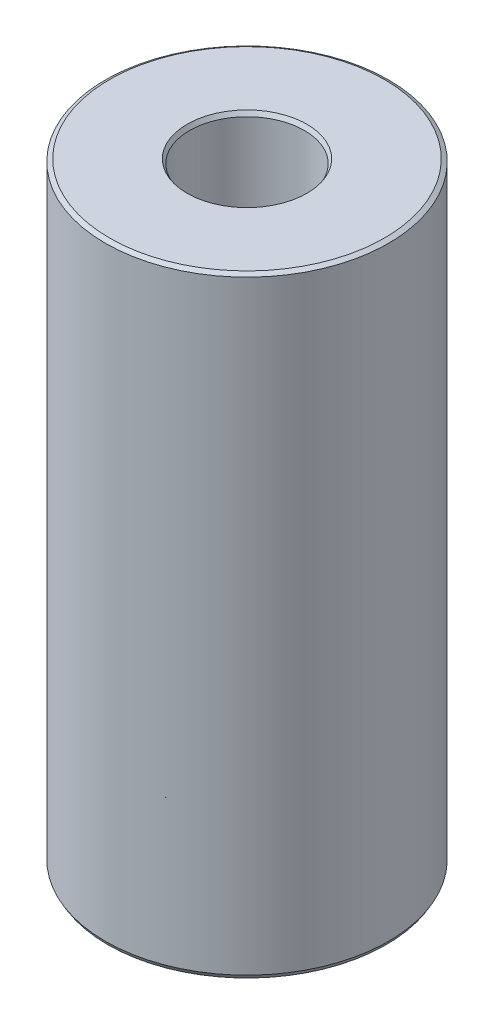
ISO-10303-21;
HEADER;
FILE_DESCRIPTION(('STEP AP214'),'2;1');
FILE_NAME('part.step','',(''),(''),'','','');
FILE_SCHEMA(('AUTOMOTIVE_DESIGN { 1 0 10303 214 1 1 1 1 }'));
ENDSEC;
DATA;
#1=APPLICATION_CONTEXT('core data for automotive mechanical design processes');
#2=APPLICATION_PROTOCOL_DEFINITION('international standard','automotive_design',2000,#1);
#3=PRODUCT_CONTEXT('',#1,'mechanical');
#4=PRODUCT('Part','Part','',(#3));
#5=PRODUCT_RELATED_PRODUCT_CATEGORY('part','',(#4));
#6=PRODUCT_DEFINITION_FORMATION('','',#4);
#7=PRODUCT_DEFINITION_CONTEXT('part definition',#1,'design');
#8=PRODUCT_DEFINITION('design','',#6,#7);
#9=PRODUCT_DEFINITION_SHAPE('','',#8);
#10=(LENGTH_UNIT() NAMED_UNIT(*) SI_UNIT(.MILLI.,.METRE.));
#11=(NAMED_UNIT(*) PLANE_ANGLE_UNIT() SI_UNIT($,.RADIAN.));
#12=(NAMED_UNIT(*) SI_UNIT($,.STERADIAN.) SOLID_ANGLE_UNIT());
#13=UNCERTAINTY_MEASURE_WITH_UNIT(LENGTH_MEASURE(1.E-05),#10,'distance_accuracy_value','');
#14=(GEOMETRIC_REPRESENTATION_CONTEXT(3) GLOBAL_UNCERTAINTY_ASSIGNED_CONTEXT((#13)) GLOBAL_UNIT_ASSIGNED_CONTEXT((#10,
#11,#12)) REPRESENTATION_CONTEXT('',''));
#15=CARTESIAN_POINT('',(0.,0.,0.));
#16=DIRECTION('',(0.,0.,1.));
#17=DIRECTION('',(1.,0.,0.));
#18=AXIS2_PLACEMENT_3D('',#15,#16,#17);
#19=CARTESIAN_POINT('',(0.,215.817890660873,0.));
#20=DIRECTION('',(0.,-1.,0.));
#21=DIRECTION('',(0.,0.,-1.));
#22=AXIS2_PLACEMENT_3D('',#19,#20,#21);
#23=CYLINDRICAL_SURFACE('',#22,50.);
#24=CARTESIAN_POINT('',(0.,1.484774727462,0.));
#25=DIRECTION('',(0.,1.,0.));
#26=DIRECTION('',(0.,0.,1.));
#27=AXIS2_PLACEMENT_3D('',#24,#25,#26);
#28=CIRCLE('',#27,50.);
#29=CARTESIAN_POINT('',(0.,1.484774727462,-50.));
#30=VERTEX_POINT('',#29);
#31=EDGE_CURVE('E10',#30,#30,#28,.T.);
#32=CARTESIAN_POINT('',(0.,214.960655572288,0.));
#33=DIRECTION('',(0.,1.,0.));
#34=DIRECTION('',(0.,0.,1.));
#35=AXIS2_PLACEMENT_3D('',#32,#33,#34);
#36=CIRCLE('',#35,50.);
#37=CARTESIAN_POINT('',(0.,214.960655572288,-50.));
#38=VERTEX_POINT('',#37);
#39=EDGE_CURVE('E50',#38,#38,#36,.F.);
#40=CARTESIAN_POINT('',(0.,1.484774727462,-50.));
#41=CARTESIAN_POINT('',(0.,3.7084818195956,-50.));
#42=CARTESIAN_POINT('',(0.,5.9321889117292,-50.));
#43=CARTESIAN_POINT('',(0.,10.3796030959964,-50.));
#44=CARTESIAN_POINT('',(0.,12.60331018813,-50.));
#45=CARTESIAN_POINT('',(0.,17.0507243723972,-50.));
#46=CARTESIAN_POINT('',(0.,19.2744314645308,-50.));
#47=CARTESIAN_POINT('',(0.,23.721845648798,-50.));
#48=CARTESIAN_POINT('',(0.,25.9455527409316,-50.));
#49=CARTESIAN_POINT('',(0.,30.3929669251988,-50.));
#50=CARTESIAN_POINT('',(0.,32.6166740173324,-50.));
#51=CARTESIAN_POINT('',(0.,37.0640882015996,-50.));
#52=CARTESIAN_POINT('',(0.,39.2877952937332,-50.));
#53=CARTESIAN_POINT('',(0.,43.7352094780004,-50.));
#54=CARTESIAN_POINT('',(0.,45.958916570134,-50.));
#55=CARTESIAN_POINT('',(0.,50.4063307544012,-50.));
#56=CARTESIAN_POINT('',(0.,52.6300378465348,-50.));
#57=CARTESIAN_POINT('',(0.,57.077452030802,-50.));
#58=CARTESIAN_POINT('',(0.,59.3011591229356,-50.));
#59=CARTESIAN_POINT('',(0.,63.7485733072028,-50.));
#60=CARTESIAN_POINT('',(0.,65.9722803993364,-50.));
#61=CARTESIAN_POINT('',(0.,70.4196945836036,-50.));
#62=CARTESIAN_POINT('',(0.,72.6434016757372,-50.));
#63=CARTESIAN_POINT('',(0.,77.0908158600044,-50.));
#64=CARTESIAN_POINT('',(0.,79.314522952138,-50.));
#65=CARTESIAN_POINT('',(0.,83.7619371364052,-50.));
#66=CARTESIAN_POINT('',(0.,85.9856442285388,-50.));
#67=CARTESIAN_POINT('',(0.,90.433058412806,-50.));
#68=CARTESIAN_POINT('',(0.,92.6567655049396,-50.));
#69=CARTESIAN_POINT('',(0.,97.1041796892068,-50.));
#70=CARTESIAN_POINT('',(0.,99.3278867813404,-50.));
#71=CARTESIAN_POINT('',(0.,103.775300965608,-50.));
#72=CARTESIAN_POINT('',(0.,105.999008057741,-50.));
#73=CARTESIAN_POINT('',(0.,110.446422242008,-50.));
#74=CARTESIAN_POINT('',(0.,112.670129334142,-50.));
#75=CARTESIAN_POINT('',(0.,117.117543518409,-50.));
#76=CARTESIAN_POINT('',(0.,119.341250610543,-50.));
#77=CARTESIAN_POINT('',(0.,123.78866479481,-50.));
#78=CARTESIAN_POINT('',(0.,126.012371886944,-50.));
#79=CARTESIAN_POINT('',(0.,130.459786071211,-50.));
#80=CARTESIAN_POINT('',(0.,132.683493163344,-50.));
#81=CARTESIAN_POINT('',(0.,137.130907347612,-50.));
#82=CARTESIAN_POINT('',(0.,139.354614439745,-50.));
#83=CARTESIAN_POINT('',(0.,143.802028624012,-50.));
#84=CARTESIAN_POINT('',(0.,146.025735716146,-50.));
#85=CARTESIAN_POINT('',(0.,150.473149900413,-50.));
#86=CARTESIAN_POINT('',(0.,152.696856992547,-50.));
#87=CARTESIAN_POINT('',(0.,157.144271176814,-50.));
#88=CARTESIAN_POINT('',(0.,159.367978268948,-50.));
#89=CARTESIAN_POINT('',(0.,163.815392453215,-50.));
#90=CARTESIAN_POINT('',(0.,166.039099545348,-50.));
#91=CARTESIAN_POINT('',(0.,170.486513729616,-50.));
#92=CARTESIAN_POINT('',(0.,172.710220821749,-50.));
#93=CARTESIAN_POINT('',(0.,177.157635006016,-50.));
#94=CARTESIAN_POINT('',(0.,179.38134209815,-50.));
#95=CARTESIAN_POINT('',(0.,183.828756282417,-50.));
#96=CARTESIAN_POINT('',(0.,186.052463374551,-50.));
#97=CARTESIAN_POINT('',(0.,190.499877558818,-50.));
#98=CARTESIAN_POINT('',(0.,192.723584650952,-50.));
#99=CARTESIAN_POINT('',(0.,197.170998835219,-50.));
#100=CARTESIAN_POINT('',(0.,199.394705927352,-50.));
#101=CARTESIAN_POINT('',(0.,203.84212011162,-50.));
#102=CARTESIAN_POINT('',(0.,206.065827203753,-50.));
#103=CARTESIAN_POINT('',(0.,210.51324138802,-50.));
#104=CARTESIAN_POINT('',(0.,212.736948480154,-50.));
#105=CARTESIAN_POINT('',(0.,214.960655572288,-50.));
#106=B_SPLINE_CURVE_WITH_KNOTS('',3,(#40,#41,#42,#43,#44,#45,#46,#47,#48,#49,#50,#51,#52,#53,
#54,#55,#56,#57,#58,#59,#60,#61,#62,#63,#64,#65,#66,#67,#68,#69,#70,#71,#72,#73,#74,#75,#76,#77,
#78,#79,#80,#81,#82,#83,#84,#85,#86,#87,#88,#89,#90,#91,#92,#93,#94,#95,#96,#97,#98,#99,#100,
#101,#102,#103,#104,#105),.UNSPECIFIED.,.F.,.F.,(4,2,2,2,2,2,2,2,2,2,2,2,2,2,2,2,2,2,2,2,2,2,2,
2,2,2,2,2,2,2,2,2,4),(0.,6.67112127640079,13.3422425528016,20.0133638292024,26.6844851056032,
33.355606382004,40.0267276584048,46.6978489348056,53.3689702112064,60.0400914876072,
66.711212764008,73.3823340404088,80.0534553168096,86.7245765932104,93.3956978696112,
100.066819146012,106.737940422413,113.409061698814,120.080182975214,126.751304251615,
133.422425528016,140.093546804417,146.764668080818,153.435789357218,160.106910633619,
166.77803191002,173.449153186421,180.120274462822,186.791395739222,193.462517015623,
200.133638292024,206.804759568425,213.475880844826),.UNSPECIFIED.);
#107=EDGE_CURVE('BSEAM39',#30,#38,#106,.T.);
#108=ORIENTED_EDGE('',*,*,#31,.T.);
#109=ORIENTED_EDGE('',*,*,#39,.T.);
#110=ORIENTED_EDGE('',*,*,#107,.T.);
#111=ORIENTED_EDGE('',*,*,#107,.F.);
#112=EDGE_LOOP('',(#108,#110,#109,#111));
#113=FACE_BOUND('',#112,.T.);
#114=ADVANCED_FACE('F39',(#113),#23,.T.);
#115=CARTESIAN_POINT('',(0.,215.817890660873,0.));
#116=DIRECTION('',(0.,1.,0.));
#117=DIRECTION('',(0.,0.,1.));
#118=AXIS2_PLACEMENT_3D('',#115,#116,#117);
#119=PLANE('',#118);
#120=CARTESIAN_POINT('',(0.,215.817890660873,0.));
#121=DIRECTION('',(0.,1.,0.));
#122=DIRECTION('',(0.,0.,1.));
#123=AXIS2_PLACEMENT_3D('',#120,#121,#122);
#124=CIRCLE('',#123,21.1518434626382);
#125=CARTESIAN_POINT('',(0.,215.817890660873,21.1518434626382));
#126=VERTEX_POINT('',#125);
#127=EDGE_CURVE('E58',#126,#126,#124,.F.);
#128=ORIENTED_EDGE('',*,*,#127,.T.);
#129=EDGE_LOOP('',(#128));
#130=FACE_BOUND('',#129,.T.);
#131=CARTESIAN_POINT('',(0.,215.817890660873,0.));
#132=DIRECTION('',(0.,1.,0.));
#133=DIRECTION('',(0.,0.,1.));
#134=AXIS2_PLACEMENT_3D('',#131,#132,#133);
#135=CIRCLE('',#134,48.5152252725387);
#136=CARTESIAN_POINT('',(0.,215.817890660873,48.5152252725387));
#137=VERTEX_POINT('',#136);
#138=EDGE_CURVE('E61',#137,#137,#135,.T.);
#139=ORIENTED_EDGE('',*,*,#138,.T.);
#140=EDGE_LOOP('',(#139));
#141=FACE_BOUND('',#140,.T.);
#142=ADVANCED_FACE('F88',(#130,#141),#119,.T.);
#143=CARTESIAN_POINT('',(0.,0.,0.));
#144=DIRECTION('',(0.,1.,0.));
#145=DIRECTION('',(0.,0.,1.));
#146=AXIS2_PLACEMENT_3D('',#143,#144,#145);
#147=PLANE('',#146);
#148=CARTESIAN_POINT('',(0.,0.,0.));
#149=DIRECTION('',(0.,1.,0.));
#150=DIRECTION('',(0.,0.,1.));
#151=AXIS2_PLACEMENT_3D('',#148,#149,#150);
#152=CIRCLE('',#151,21.7793831015137);
#153=CARTESIAN_POINT('',(0.,0.,21.7793831015137));
#154=VERTEX_POINT('',#153);
#155=EDGE_CURVE('E51',#154,#154,#152,.T.);
#156=ORIENTED_EDGE('',*,*,#155,.T.);
#157=EDGE_LOOP('',(#156));
#158=FACE_BOUND('',#157,.T.);
#159=CARTESIAN_POINT('',(0.,0.,0.));
#160=DIRECTION('',(0.,1.,0.));
#161=DIRECTION('',(0.,0.,1.));
#162=AXIS2_PLACEMENT_3D('',#159,#160,#161);
#163=CIRCLE('',#162,49.1427649114139);
#164=CARTESIAN_POINT('',(0.,0.,49.1427649114139));
#165=VERTEX_POINT('',#164);
#166=EDGE_CURVE('E54',#165,#165,#163,.F.);
#167=ORIENTED_EDGE('',*,*,#166,.T.);
#168=EDGE_LOOP('',(#167));
#169=FACE_BOUND('',#168,.T.);
#170=ADVANCED_FACE('F83',(#158,#169),#147,.F.);
#171=CARTESIAN_POINT('',(0.,215.817890660873,0.));
#172=DIRECTION('',(0.,-1.,0.));
#173=DIRECTION('',(0.,0.,-1.));
#174=AXIS2_PLACEMENT_3D('',#171,#172,#173);
#175=CYLINDRICAL_SURFACE('',#174,20.2946083740523);
#176=CARTESIAN_POINT('',(0.,214.333115933412,0.));
#177=DIRECTION('',(0.,1.,0.));
#178=DIRECTION('',(0.,0.,1.));
#179=AXIS2_PLACEMENT_3D('',#176,#177,#178);
#180=CIRCLE('',#179,20.2946083740523);
#181=CARTESIAN_POINT('',(0.,214.333115933412,-20.2946083740523));
#182=VERTEX_POINT('',#181);
#183=EDGE_CURVE('E67',#182,#182,#180,.T.);
#184=CARTESIAN_POINT('',(0.,0.857235088585789,0.));
#185=DIRECTION('',(0.,1.,0.));
#186=DIRECTION('',(0.,0.,1.));
#187=AXIS2_PLACEMENT_3D('',#184,#185,#186);
#188=CIRCLE('',#187,20.2946083740523);
#189=CARTESIAN_POINT('',(0.,0.857235088585762,-20.2946083740523));
#190=VERTEX_POINT('',#189);
#191=EDGE_CURVE('E69',#190,#190,#188,.F.);
#192=CARTESIAN_POINT('',(0.,214.333115933412,-20.2946083740523));
#193=CARTESIAN_POINT('',(0.,212.109408841278,-20.2946083740523));
#194=CARTESIAN_POINT('',(0.,209.885701749144,-20.2946083740523));
#195=CARTESIAN_POINT('',(0.,205.438287564877,-20.2946083740523));
#196=CARTESIAN_POINT('',(0.,203.214580472744,-20.2946083740523));
#197=CARTESIAN_POINT('',(0.,198.767166288476,-20.2946083740523));
#198=CARTESIAN_POINT('',(0.,196.543459196343,-20.2946083740523));
#199=CARTESIAN_POINT('',(0.,192.096045012076,-20.2946083740523));
#200=CARTESIAN_POINT('',(0.,189.872337919942,-20.2946083740523));
#201=CARTESIAN_POINT('',(0.,185.424923735675,-20.2946083740523));
#202=CARTESIAN_POINT('',(0.,183.201216643541,-20.2946083740523));
#203=CARTESIAN_POINT('',(0.,178.753802459274,-20.2946083740523));
#204=CARTESIAN_POINT('',(0.,176.53009536714,-20.2946083740523));
#205=CARTESIAN_POINT('',(0.,172.082681182873,-20.2946083740523));
#206=CARTESIAN_POINT('',(0.,169.85897409074,-20.2946083740523));
#207=CARTESIAN_POINT('',(0.,165.411559906472,-20.2946083740523));
#208=CARTESIAN_POINT('',(0.,163.187852814339,-20.2946083740523));
#209=CARTESIAN_POINT('',(0.,158.740438630072,-20.2946083740523));
#210=CARTESIAN_POINT('',(0.,156.516731537938,-20.2946083740523));
#211=CARTESIAN_POINT('',(0.,152.069317353671,-20.2946083740523));
#212=CARTESIAN_POINT('',(0.,149.845610261537,-20.2946083740523));
#213=CARTESIAN_POINT('',(0.,145.39819607727,-20.2946083740523));
#214=CARTESIAN_POINT('',(0.,143.174488985136,-20.2946083740523));
#215=CARTESIAN_POINT('',(0.,138.727074800869,-20.2946083740523));
#216=CARTESIAN_POINT('',(0.,136.503367708736,-20.2946083740523));
#217=CARTESIAN_POINT('',(0.,132.055953524468,-20.2946083740523));
#218=CARTESIAN_POINT('',(0.,129.832246432335,-20.2946083740523));
#219=CARTESIAN_POINT('',(0.,125.384832248068,-20.2946083740523));
#220=CARTESIAN_POINT('',(0.,123.161125155934,-20.2946083740523));
#221=CARTESIAN_POINT('',(0.,118.713710971667,-20.2946083740523));
#222=CARTESIAN_POINT('',(0.,116.490003879533,-20.2946083740523));
#223=CARTESIAN_POINT('',(0.,112.042589695266,-20.2946083740523));
#224=CARTESIAN_POINT('',(0.,109.818882603132,-20.2946083740523));
#225=CARTESIAN_POINT('',(0.,105.371468418865,-20.2946083740523));
#226=CARTESIAN_POINT('',(0.,103.147761326732,-20.2946083740523));
#227=CARTESIAN_POINT('',(0.,98.7003471424643,-20.2946083740523));
#228=CARTESIAN_POINT('',(0.,96.4766400503307,-20.2946083740523));
#229=CARTESIAN_POINT('',(0.,92.0292258660635,-20.2946083740523));
#230=CARTESIAN_POINT('',(0.,89.8055187739299,-20.2946083740523));
#231=CARTESIAN_POINT('',(0.,85.3581045896627,-20.2946083740523));
#232=CARTESIAN_POINT('',(0.,83.1343974975291,-20.2946083740523));
#233=CARTESIAN_POINT('',(0.,78.6869833132619,-20.2946083740523));
#234=CARTESIAN_POINT('',(0.,76.4632762211283,-20.2946083740523));
#235=CARTESIAN_POINT('',(0.,72.0158620368611,-20.2946083740523));
#236=CARTESIAN_POINT('',(0.,69.7921549447275,-20.2946083740523));
#237=CARTESIAN_POINT('',(0.,65.3447407604603,-20.2946083740523));
#238=CARTESIAN_POINT('',(0.,63.1210336683267,-20.2946083740523));
#239=CARTESIAN_POINT('',(0.,58.6736194840595,-20.2946083740523));
#240=CARTESIAN_POINT('',(0.,56.4499123919258,-20.2946083740523));
#241=CARTESIAN_POINT('',(0.,52.0024982076586,-20.2946083740523));
#242=CARTESIAN_POINT('',(0.,49.778791115525,-20.2946083740523));
#243=CARTESIAN_POINT('',(0.,45.3313769312578,-20.2946083740523));
#244=CARTESIAN_POINT('',(0.,43.1076698391242,-20.2946083740523));
#245=CARTESIAN_POINT('',(0.,38.660255654857,-20.2946083740523));
#246=CARTESIAN_POINT('',(0.,36.4365485627234,-20.2946083740523));
#247=CARTESIAN_POINT('',(0.,31.9891343784562,-20.2946083740523));
#248=CARTESIAN_POINT('',(0.,29.7654272863226,-20.2946083740523));
#249=CARTESIAN_POINT('',(0.,25.3180131020554,-20.2946083740523));
#250=CARTESIAN_POINT('',(0.,23.0943060099218,-20.2946083740523));
#251=CARTESIAN_POINT('',(0.,18.6468918256546,-20.2946083740523));
#252=CARTESIAN_POINT('',(0.,16.423184733521,-20.2946083740523));
#253=CARTESIAN_POINT('',(0.,11.9757705492538,-20.2946083740523));
#254=CARTESIAN_POINT('',(0.,9.75206345712018,-20.2946083740523));
#255=CARTESIAN_POINT('',(0.,5.30464927285298,-20.2946083740523));
#256=CARTESIAN_POINT('',(0.,3.08094218071937,-20.2946083740523));
#257=CARTESIAN_POINT('',(0.,0.857235088585762,-20.2946083740523));
#258=B_SPLINE_CURVE_WITH_KNOTS('',3,(#192,#193,#194,#195,#196,#197,#198,#199,#200,#201,#202,
#203,#204,#205,#206,#207,#208,#209,#210,#211,#212,#213,#214,#215,#216,#217,#218,#219,#220,#221,
#222,#223,#224,#225,#226,#227,#228,#229,#230,#231,#232,#233,#234,#235,#236,#237,#238,#239,#240,
#241,#242,#243,#244,#245,#246,#247,#248,#249,#250,#251,#252,#253,#254,#255,#256,#257),
.UNSPECIFIED.,.F.,.F.,(4,2,2,2,2,2,2,2,2,2,2,2,2,2,2,2,2,2,2,2,2,2,2,2,2,2,2,2,2,2,2,2,4),(0.,
6.67112127640079,13.3422425528016,20.0133638292024,26.6844851056032,33.355606382004,
40.0267276584048,46.6978489348057,53.3689702112065,60.0400914876073,66.7112127640081,
73.3823340404089,80.0534553168097,86.7245765932105,93.3956978696113,100.066819146012,
106.737940422413,113.409061698814,120.080182975215,126.751304251615,133.422425528016,
140.093546804417,146.764668080818,153.435789357219,160.106910633619,166.77803191002,
173.449153186421,180.120274462822,186.791395739223,193.462517015623,200.133638292024,
206.804759568425,213.475880844826),.UNSPECIFIED.);
#259=EDGE_CURVE('BSEAM71',#182,#190,#258,.T.);
#260=ORIENTED_EDGE('',*,*,#183,.T.);
#261=ORIENTED_EDGE('',*,*,#191,.T.);
#262=ORIENTED_EDGE('',*,*,#259,.T.);
#263=ORIENTED_EDGE('',*,*,#259,.F.);
#264=EDGE_LOOP('',(#260,#262,#261,#263));
#265=FACE_BOUND('',#264,.T.);
#266=ADVANCED_FACE('F71',(#265),#175,.F.);
#267=CARTESIAN_POINT('',(0.,214.333115933412,0.));
#268=DIRECTION('',(0.,1.,0.));
#269=DIRECTION('',(0.,0.,1.));
#270=AXIS2_PLACEMENT_3D('',#267,#268,#269);
#271=CONICAL_SURFACE('',#270,20.2946083740523,0.523598775598303);
#272=ORIENTED_EDGE('',*,*,#127,.F.);
#273=EDGE_LOOP('',(#272));
#274=FACE_BOUND('',#273,.T.);
#275=ORIENTED_EDGE('',*,*,#183,.F.);
#276=EDGE_LOOP('',(#275));
#277=FACE_BOUND('',#276,.T.);
#278=ADVANCED_FACE('F77',(#274,#277),#271,.F.);
#279=CARTESIAN_POINT('',(0.,0.,0.));
#280=DIRECTION('',(0.,-1.,0.));
#281=DIRECTION('',(0.,0.,-1.));
#282=AXIS2_PLACEMENT_3D('',#279,#280,#281);
#283=CONICAL_SURFACE('',#282,21.7793831015137,1.0471975511966);
#284=ORIENTED_EDGE('',*,*,#191,.F.);
#285=EDGE_LOOP('',(#284));
#286=FACE_BOUND('',#285,.T.);
#287=ORIENTED_EDGE('',*,*,#155,.F.);
#288=EDGE_LOOP('',(#287));
#289=FACE_BOUND('',#288,.T.);
#290=ADVANCED_FACE('F73',(#286,#289),#283,.F.);
#291=CARTESIAN_POINT('',(0.,1.484774727462,0.));
#292=DIRECTION('',(0.,1.,0.));
#293=DIRECTION('',(0.,0.,1.));
#294=AXIS2_PLACEMENT_3D('',#291,#292,#293);
#295=CONICAL_SURFACE('',#294,50.,0.523598775598297);
#296=ORIENTED_EDGE('',*,*,#166,.F.);
#297=EDGE_LOOP('',(#296));
#298=FACE_BOUND('',#297,.T.);
#299=ORIENTED_EDGE('',*,*,#31,.F.);
#300=EDGE_LOOP('',(#299));
#301=FACE_BOUND('',#300,.T.);
#302=ADVANCED_FACE('F76',(#298,#301),#295,.T.);
#303=CARTESIAN_POINT('',(0.,215.817890660873,0.));
#304=DIRECTION('',(0.,-1.,0.));
#305=DIRECTION('',(0.,0.,-1.));
#306=AXIS2_PLACEMENT_3D('',#303,#304,#305);
#307=CONICAL_SURFACE('',#306,48.5152252725387,1.04719755119659);
#308=ORIENTED_EDGE('',*,*,#39,.F.);
#309=EDGE_LOOP('',(#308));
#310=FACE_BOUND('',#309,.T.);
#311=ORIENTED_EDGE('',*,*,#138,.F.);
#312=EDGE_LOOP('',(#311));
#313=FACE_BOUND('',#312,.T.);
#314=ADVANCED_FACE('F45',(#310,#313),#307,.T.);
#315=CLOSED_SHELL('',(#114,#142,#170,#266,#278,#290,#302,#314));
#316=MANIFOLD_SOLID_BREP('B2',#315);
#317=ADVANCED_BREP_SHAPE_REPRESENTATION('',(#18,#316),#14);
#318=SHAPE_DEFINITION_REPRESENTATION(#9,#317);
ENDSEC;
END-ISO-10303-21;
